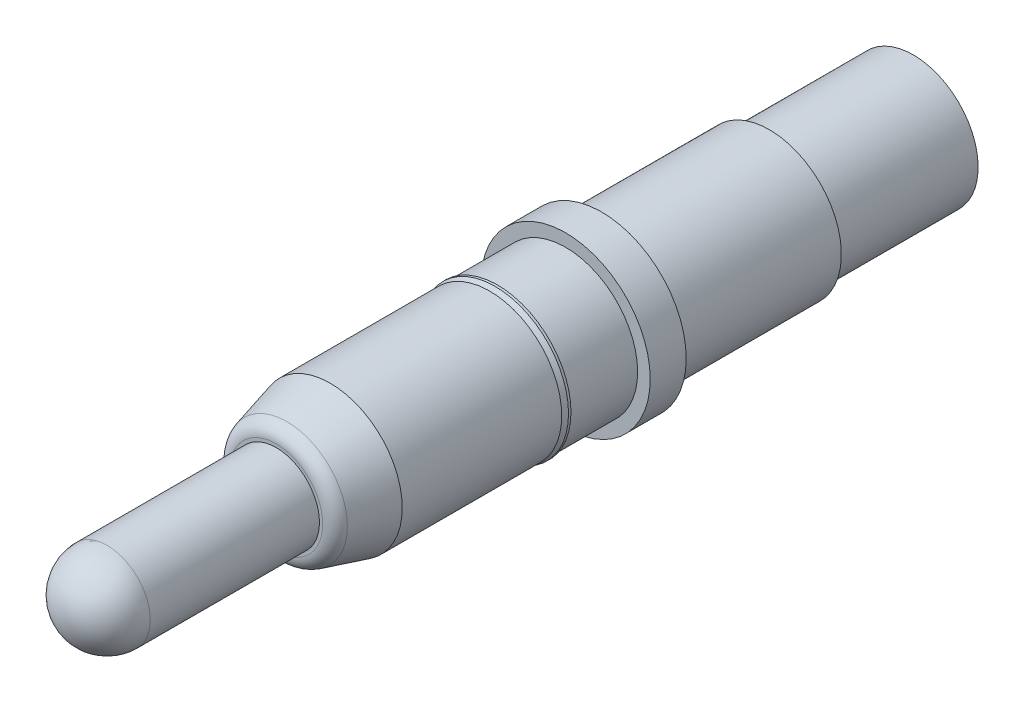
ISO-10303-21;
HEADER;
FILE_DESCRIPTION(('STEP AP214'),'2;1');
FILE_NAME('part.step','',(''),(''),'','','');
FILE_SCHEMA(('AUTOMOTIVE_DESIGN { 1 0 10303 214 1 1 1 1 }'));
ENDSEC;
DATA;
#1=APPLICATION_CONTEXT('core data for automotive mechanical design processes');
#2=APPLICATION_PROTOCOL_DEFINITION('international standard','automotive_design',2000,#1);
#3=PRODUCT_CONTEXT('',#1,'mechanical');
#4=PRODUCT('Part','Part','',(#3));
#5=PRODUCT_RELATED_PRODUCT_CATEGORY('part','',(#4));
#6=PRODUCT_DEFINITION_FORMATION('','',#4);
#7=PRODUCT_DEFINITION_CONTEXT('part definition',#1,'design');
#8=PRODUCT_DEFINITION('design','',#6,#7);
#9=PRODUCT_DEFINITION_SHAPE('','',#8);
#10=(LENGTH_UNIT() NAMED_UNIT(*) SI_UNIT(.MILLI.,.METRE.));
#11=(NAMED_UNIT(*) PLANE_ANGLE_UNIT() SI_UNIT($,.RADIAN.));
#12=(NAMED_UNIT(*) SI_UNIT($,.STERADIAN.) SOLID_ANGLE_UNIT());
#13=UNCERTAINTY_MEASURE_WITH_UNIT(LENGTH_MEASURE(1.E-05),#10,'distance_accuracy_value','');
#14=(GEOMETRIC_REPRESENTATION_CONTEXT(3) GLOBAL_UNCERTAINTY_ASSIGNED_CONTEXT((#13)) GLOBAL_UNIT_ASSIGNED_CONTEXT((#10,
#11,#12)) REPRESENTATION_CONTEXT('',''));
#15=CARTESIAN_POINT('',(0.,0.,0.));
#16=DIRECTION('',(0.,0.,1.));
#17=DIRECTION('',(1.,0.,0.));
#18=AXIS2_PLACEMENT_3D('',#15,#16,#17);
#19=CARTESIAN_POINT('',(0.,0.,-0.5));
#20=DIRECTION('',(0.,0.,1.));
#21=DIRECTION('',(1.,0.,0.));
#22=AXIS2_PLACEMENT_3D('',#19,#20,#21);
#23=CYLINDRICAL_SURFACE('',#22,1.175);
#24=CARTESIAN_POINT('',(0.,0.,-0.5));
#25=DIRECTION('',(0.,0.,1.));
#26=DIRECTION('',(1.,0.,0.));
#27=AXIS2_PLACEMENT_3D('',#24,#25,#26);
#28=CIRCLE('',#27,1.175);
#29=CARTESIAN_POINT('',(1.175,0.,-0.5));
#30=VERTEX_POINT('',#29);
#31=EDGE_CURVE('P0_E142',#30,#30,#28,.T.);
#32=ORIENTED_EDGE('',*,*,#31,.T.);
#33=EDGE_LOOP('',(#32));
#34=FACE_BOUND('',#33,.T.);
#35=CARTESIAN_POINT('',(0.,0.,0.));
#36=DIRECTION('',(0.,0.,1.));
#37=DIRECTION('',(1.,0.,0.));
#38=AXIS2_PLACEMENT_3D('',#35,#36,#37);
#39=CIRCLE('',#38,1.175);
#40=CARTESIAN_POINT('',(1.175,0.,0.));
#41=VERTEX_POINT('',#40);
#42=EDGE_CURVE('P0_E78',#41,#41,#39,.T.);
#43=ORIENTED_EDGE('',*,*,#42,.F.);
#44=EDGE_LOOP('',(#43));
#45=FACE_BOUND('',#44,.T.);
#46=ADVANCED_FACE('P0_F42',(#34,#45),#23,.T.);
#47=CARTESIAN_POINT('',(1.175,0.,-0.5));
#48=DIRECTION('',(0.,0.,-1.));
#49=DIRECTION('',(-1.,0.,0.));
#50=AXIS2_PLACEMENT_3D('',#47,#48,#49);
#51=PLANE('',#50);
#52=CARTESIAN_POINT('',(0.,0.,-0.5));
#53=DIRECTION('',(0.,0.,-1.));
#54=DIRECTION('',(-1.,0.,0.));
#55=AXIS2_PLACEMENT_3D('',#52,#53,#54);
#56=CIRCLE('',#55,1.);
#57=CARTESIAN_POINT('',(-1.,0.,-0.5));
#58=VERTEX_POINT('',#57);
#59=EDGE_CURVE('P0_E71',#58,#58,#56,.T.);
#60=ORIENTED_EDGE('',*,*,#59,.F.);
#61=EDGE_LOOP('',(#60));
#62=FACE_BOUND('',#61,.T.);
#63=ORIENTED_EDGE('',*,*,#31,.F.);
#64=EDGE_LOOP('',(#63));
#65=FACE_BOUND('',#64,.T.);
#66=ADVANCED_FACE('P0_F116',(#62,#65),#51,.T.);
#67=CARTESIAN_POINT('',(0.,0.,4.02));
#68=DIRECTION('',(0.,0.,1.));
#69=DIRECTION('',(1.,0.,0.));
#70=AXIS2_PLACEMENT_3D('',#67,#68,#69);
#71=PLANE('',#70);
#72=CARTESIAN_POINT('',(0.,0.,4.02));
#73=DIRECTION('',(0.,0.,1.));
#74=DIRECTION('',(1.,0.,0.));
#75=AXIS2_PLACEMENT_3D('',#72,#73,#74);
#76=CIRCLE('',#75,0.645572708091596);
#77=CARTESIAN_POINT('',(0.645572708091596,0.,4.02));
#78=VERTEX_POINT('',#77);
#79=EDGE_CURVE('P0_E50',#78,#78,#76,.T.);
#80=ORIENTED_EDGE('',*,*,#79,.T.);
#81=EDGE_LOOP('',(#80));
#82=FACE_BOUND('',#81,.T.);
#83=CARTESIAN_POINT('',(0.,0.,4.02));
#84=DIRECTION('',(0.,0.,1.));
#85=DIRECTION('',(1.,0.,0.));
#86=AXIS2_PLACEMENT_3D('',#83,#84,#85);
#87=CIRCLE('',#86,0.6);
#88=CARTESIAN_POINT('',(0.6,0.,4.02));
#89=VERTEX_POINT('',#88);
#90=EDGE_CURVE('P0_E62',#89,#89,#87,.T.);
#91=ORIENTED_EDGE('',*,*,#90,.F.);
#92=EDGE_LOOP('',(#91));
#93=FACE_BOUND('',#92,.T.);
#94=ADVANCED_FACE('P0_F112',(#82,#93),#71,.T.);
#95=CARTESIAN_POINT('',(0.,0.,4.02));
#96=DIRECTION('',(0.,0.,-1.));
#97=DIRECTION('',(-1.,0.,0.));
#98=AXIS2_PLACEMENT_3D('',#95,#96,#97);
#99=CONICAL_SURFACE('',#98,0.799038105690031,0.261799387782513);
#100=CARTESIAN_POINT('',(0.,0.,3.87176380901729));
#101=DIRECTION('',(0.,0.,1.));
#102=DIRECTION('',(1.,0.,0.));
#103=AXIS2_PLACEMENT_3D('',#100,#101,#102);
#104=CIRCLE('',#103,0.838757873350271);
#105=CARTESIAN_POINT('',(0.838757873350271,0.,3.87176380901729));
#106=VERTEX_POINT('',#105);
#107=EDGE_CURVE('P0_E11',#106,#106,#104,.F.);
#108=ORIENTED_EDGE('',*,*,#107,.T.);
#109=EDGE_LOOP('',(#108));
#110=FACE_BOUND('',#109,.T.);
#111=CARTESIAN_POINT('',(0.,0.,3.27));
#112=DIRECTION('',(0.,0.,1.));
#113=DIRECTION('',(1.,0.,0.));
#114=AXIS2_PLACEMENT_3D('',#111,#112,#113);
#115=CIRCLE('',#114,1.);
#116=CARTESIAN_POINT('',(1.,0.,3.27));
#117=VERTEX_POINT('',#116);
#118=EDGE_CURVE('P0_E146',#117,#117,#115,.T.);
#119=ORIENTED_EDGE('',*,*,#118,.T.);
#120=EDGE_LOOP('',(#119));
#121=FACE_BOUND('',#120,.T.);
#122=ADVANCED_FACE('P0_F108',(#110,#121),#99,.T.);
#123=CARTESIAN_POINT('',(0.,0.,-0.5));
#124=DIRECTION('',(0.,0.,1.));
#125=DIRECTION('',(1.,0.,0.));
#126=AXIS2_PLACEMENT_3D('',#123,#124,#125);
#127=CYLINDRICAL_SURFACE('',#126,1.);
#128=CARTESIAN_POINT('',(0.,0.,1.05442139880552));
#129=DIRECTION('',(0.,0.,1.));
#130=DIRECTION('',(1.,0.,0.));
#131=AXIS2_PLACEMENT_3D('',#128,#129,#130);
#132=CIRCLE('',#131,1.);
#133=CARTESIAN_POINT('',(1.,0.,1.05442139880552));
#134=VERTEX_POINT('',#133);
#135=EDGE_CURVE('P0_E170',#134,#134,#132,.T.);
#136=ORIENTED_EDGE('',*,*,#135,.T.);
#137=EDGE_LOOP('',(#136));
#138=FACE_BOUND('',#137,.T.);
#139=ORIENTED_EDGE('',*,*,#118,.F.);
#140=EDGE_LOOP('',(#139));
#141=FACE_BOUND('',#140,.T.);
#142=ADVANCED_FACE('P0_F104',(#138,#141),#127,.T.);
#143=CARTESIAN_POINT('',(0.,0.,1.05442139880552));
#144=DIRECTION('',(0.,0.,-1.));
#145=DIRECTION('',(-1.,0.,0.));
#146=AXIS2_PLACEMENT_3D('',#143,#144,#145);
#147=CONICAL_SURFACE('',#146,1.,0.26179938795119);
#148=CARTESIAN_POINT('',(0.,0.,0.979780382717352));
#149=DIRECTION('',(0.,0.,1.));
#150=DIRECTION('',(1.,0.,0.));
#151=AXIS2_PLACEMENT_3D('',#148,#149,#150);
#152=CIRCLE('',#151,1.01999999999523);
#153=CARTESIAN_POINT('',(1.01999999999523,0.,0.979780382717352));
#154=VERTEX_POINT('',#153);
#155=EDGE_CURVE('P0_E167',#154,#154,#152,.T.);
#156=ORIENTED_EDGE('',*,*,#155,.T.);
#157=EDGE_LOOP('',(#156));
#158=FACE_BOUND('',#157,.T.);
#159=ORIENTED_EDGE('',*,*,#135,.F.);
#160=EDGE_LOOP('',(#159));
#161=FACE_BOUND('',#160,.T.);
#162=ADVANCED_FACE('P0_F100',(#158,#161),#147,.T.);
#163=CARTESIAN_POINT('',(0.,0.,-0.5));
#164=DIRECTION('',(0.,0.,1.));
#165=DIRECTION('',(1.,0.,0.));
#166=AXIS2_PLACEMENT_3D('',#163,#164,#165);
#167=CYLINDRICAL_SURFACE('',#166,1.01999999999523);
#168=CARTESIAN_POINT('',(0.,0.,0.946167322600402));
#169=DIRECTION('',(0.,0.,1.));
#170=DIRECTION('',(1.,0.,0.));
#171=AXIS2_PLACEMENT_3D('',#168,#169,#170);
#172=CIRCLE('',#171,1.01999999999523);
#173=CARTESIAN_POINT('',(1.01999999999523,0.,0.946167322600402));
#174=VERTEX_POINT('',#173);
#175=EDGE_CURVE('P0_E162',#174,#174,#172,.T.);
#176=ORIENTED_EDGE('',*,*,#175,.T.);
#177=EDGE_LOOP('',(#176));
#178=FACE_BOUND('',#177,.T.);
#179=ORIENTED_EDGE('',*,*,#155,.F.);
#180=EDGE_LOOP('',(#179));
#181=FACE_BOUND('',#180,.T.);
#182=ADVANCED_FACE('P0_F96',(#178,#181),#167,.T.);
#183=CARTESIAN_POINT('',(1.01999999999523,0.,0.946167322600402));
#184=DIRECTION('',(0.,0.,-1.));
#185=DIRECTION('',(-1.,0.,0.));
#186=AXIS2_PLACEMENT_3D('',#183,#184,#185);
#187=PLANE('',#186);
#188=CARTESIAN_POINT('',(0.,0.,0.946167322600402));
#189=DIRECTION('',(0.,0.,1.));
#190=DIRECTION('',(1.,0.,0.));
#191=AXIS2_PLACEMENT_3D('',#188,#189,#190);
#192=CIRCLE('',#191,1.);
#193=CARTESIAN_POINT('',(1.,0.,0.946167322600402));
#194=VERTEX_POINT('',#193);
#195=EDGE_CURVE('P0_E159',#194,#194,#192,.T.);
#196=ORIENTED_EDGE('',*,*,#195,.T.);
#197=EDGE_LOOP('',(#196));
#198=FACE_BOUND('',#197,.T.);
#199=ORIENTED_EDGE('',*,*,#175,.F.);
#200=EDGE_LOOP('',(#199));
#201=FACE_BOUND('',#200,.T.);
#202=ADVANCED_FACE('P0_F92',(#198,#201),#187,.T.);
#203=CARTESIAN_POINT('',(0.,0.,-0.5));
#204=DIRECTION('',(0.,0.,1.));
#205=DIRECTION('',(1.,0.,0.));
#206=AXIS2_PLACEMENT_3D('',#203,#204,#205);
#207=CYLINDRICAL_SURFACE('',#206,1.);
#208=CARTESIAN_POINT('',(0.,0.,0.));
#209=DIRECTION('',(0.,0.,1.));
#210=DIRECTION('',(1.,0.,0.));
#211=AXIS2_PLACEMENT_3D('',#208,#209,#210);
#212=CIRCLE('',#211,1.);
#213=CARTESIAN_POINT('',(1.,0.,0.));
#214=VERTEX_POINT('',#213);
#215=EDGE_CURVE('P0_E156',#214,#214,#212,.T.);
#216=ORIENTED_EDGE('',*,*,#215,.T.);
#217=EDGE_LOOP('',(#216));
#218=FACE_BOUND('',#217,.T.);
#219=ORIENTED_EDGE('',*,*,#195,.F.);
#220=EDGE_LOOP('',(#219));
#221=FACE_BOUND('',#220,.T.);
#222=ADVANCED_FACE('P0_F88',(#218,#221),#207,.T.);
#223=CARTESIAN_POINT('',(1.,0.,0.));
#224=DIRECTION('',(0.,0.,1.));
#225=DIRECTION('',(1.,0.,0.));
#226=AXIS2_PLACEMENT_3D('',#223,#224,#225);
#227=PLANE('',#226);
#228=ORIENTED_EDGE('',*,*,#42,.T.);
#229=EDGE_LOOP('',(#228));
#230=FACE_BOUND('',#229,.T.);
#231=ORIENTED_EDGE('',*,*,#215,.F.);
#232=EDGE_LOOP('',(#231));
#233=FACE_BOUND('',#232,.T.);
#234=ADVANCED_FACE('P0_F84',(#230,#233),#227,.T.);
#235=CARTESIAN_POINT('',(0.,0.,6.37));
#236=DIRECTION('',(0.,-1.,0.));
#237=DIRECTION('',(0.,0.,-1.));
#238=AXIS2_PLACEMENT_3D('',#235,#236,#237);
#239=SPHERICAL_SURFACE('',#238,0.6);
#240=CARTESIAN_POINT('',(0.,0.,6.37));
#241=DIRECTION('',(0.,0.,1.));
#242=DIRECTION('',(0.,-1.,0.));
#243=AXIS2_PLACEMENT_3D('',#240,#241,#242);
#244=CIRCLE('',#243,0.6);
#245=CARTESIAN_POINT('',(0.,0.6,6.37));
#246=VERTEX_POINT('',#245);
#247=CARTESIAN_POINT('',(0.,-0.6,6.37));
#248=VERTEX_POINT('',#247);
#249=EDGE_CURVE('P0_E58',#246,#248,#244,.F.);
#250=ORIENTED_EDGE('',*,*,#249,.F.);
#251=CARTESIAN_POINT('',(0.,0.,6.37));
#252=DIRECTION('',(0.,0.,1.));
#253=DIRECTION('',(0.,-1.,0.));
#254=AXIS2_PLACEMENT_3D('',#251,#252,#253);
#255=CIRCLE('',#254,0.6);
#256=EDGE_CURVE('P0_E56',#248,#246,#255,.F.);
#257=ORIENTED_EDGE('',*,*,#256,.F.);
#258=EDGE_LOOP('',(#250,#257));
#259=FACE_BOUND('',#258,.T.);
#260=ADVANCED_FACE('P0_F59',(#259),#239,.T.);
#261=CARTESIAN_POINT('',(0.,0.,8.12857639578479));
#262=DIRECTION('',(0.,0.,-1.));
#263=DIRECTION('',(-1.,0.,0.));
#264=AXIS2_PLACEMENT_3D('',#261,#262,#263);
#265=CYLINDRICAL_SURFACE('',#264,0.6);
#266=ORIENTED_EDGE('',*,*,#256,.T.);
#267=ORIENTED_EDGE('',*,*,#249,.T.);
#268=EDGE_LOOP('',(#266,#267));
#269=FACE_BOUND('',#268,.T.);
#270=ORIENTED_EDGE('',*,*,#90,.T.);
#271=EDGE_LOOP('',(#270));
#272=FACE_BOUND('',#271,.T.);
#273=ADVANCED_FACE('P0_F64',(#269,#272),#265,.T.);
#274=CARTESIAN_POINT('',(0.,0.,-2.83));
#275=DIRECTION('',(0.,0.,1.));
#276=DIRECTION('',(1.,0.,0.));
#277=AXIS2_PLACEMENT_3D('',#274,#275,#276);
#278=CYLINDRICAL_SURFACE('',#277,1.);
#279=CARTESIAN_POINT('',(0.,0.,-2.83));
#280=DIRECTION('',(0.,0.,-1.));
#281=DIRECTION('',(-1.,0.,0.));
#282=AXIS2_PLACEMENT_3D('',#279,#280,#281);
#283=CIRCLE('',#282,1.);
#284=CARTESIAN_POINT('',(-1.,0.,-2.83));
#285=VERTEX_POINT('',#284);
#286=EDGE_CURVE('P0_E67',#285,#285,#283,.T.);
#287=ORIENTED_EDGE('',*,*,#286,.F.);
#288=EDGE_LOOP('',(#287));
#289=FACE_BOUND('',#288,.T.);
#290=ORIENTED_EDGE('',*,*,#59,.T.);
#291=EDGE_LOOP('',(#290));
#292=FACE_BOUND('',#291,.T.);
#293=ADVANCED_FACE('P0_F187',(#289,#292),#278,.T.);
#294=CARTESIAN_POINT('',(0.,0.,-2.83));
#295=DIRECTION('',(0.,0.,-1.));
#296=DIRECTION('',(-1.,0.,0.));
#297=AXIS2_PLACEMENT_3D('',#294,#295,#296);
#298=PLANE('',#297);
#299=CARTESIAN_POINT('',(0.,0.,-2.83));
#300=DIRECTION('',(0.,0.,-1.));
#301=DIRECTION('',(-1.,0.,0.));
#302=AXIS2_PLACEMENT_3D('',#299,#300,#301);
#303=CIRCLE('',#302,0.9);
#304=CARTESIAN_POINT('',(-0.9,0.,-2.83));
#305=VERTEX_POINT('',#304);
#306=EDGE_CURVE('P0_E238',#305,#305,#303,.T.);
#307=ORIENTED_EDGE('',*,*,#306,.F.);
#308=EDGE_LOOP('',(#307));
#309=FACE_BOUND('',#308,.T.);
#310=ORIENTED_EDGE('',*,*,#286,.T.);
#311=EDGE_LOOP('',(#310));
#312=FACE_BOUND('',#311,.T.);
#313=ADVANCED_FACE('P0_F191',(#309,#312),#298,.T.);
#314=CARTESIAN_POINT('',(0.,0.,-4.83));
#315=DIRECTION('',(0.,0.,1.));
#316=DIRECTION('',(1.,0.,0.));
#317=AXIS2_PLACEMENT_3D('',#314,#315,#316);
#318=CYLINDRICAL_SURFACE('',#317,0.9);
#319=CARTESIAN_POINT('',(0.,0.,-4.83));
#320=DIRECTION('',(0.,0.,-1.));
#321=DIRECTION('',(-1.,0.,0.));
#322=AXIS2_PLACEMENT_3D('',#319,#320,#321);
#323=CIRCLE('',#322,0.9);
#324=CARTESIAN_POINT('',(-0.9,0.,-4.83));
#325=VERTEX_POINT('',#324);
#326=EDGE_CURVE('P0_E239',#325,#325,#323,.T.);
#327=ORIENTED_EDGE('',*,*,#326,.F.);
#328=EDGE_LOOP('',(#327));
#329=FACE_BOUND('',#328,.T.);
#330=ORIENTED_EDGE('',*,*,#306,.T.);
#331=EDGE_LOOP('',(#330));
#332=FACE_BOUND('',#331,.T.);
#333=ADVANCED_FACE('P0_F196',(#329,#332),#318,.T.);
#334=CARTESIAN_POINT('',(0.,0.,-4.83));
#335=DIRECTION('',(0.,0.,-1.));
#336=DIRECTION('',(-1.,0.,0.));
#337=AXIS2_PLACEMENT_3D('',#334,#335,#336);
#338=PLANE('',#337);
#339=CARTESIAN_POINT('',(0.,0.,-4.83));
#340=DIRECTION('',(0.,0.,-1.));
#341=DIRECTION('',(-1.,0.,0.));
#342=AXIS2_PLACEMENT_3D('',#339,#340,#341);
#343=CIRCLE('',#342,0.834999999974913);
#344=CARTESIAN_POINT('',(-0.834999999974913,0.,-4.83));
#345=VERTEX_POINT('',#344);
#346=EDGE_CURVE('P0_E138',#345,#345,#343,.F.);
#347=ORIENTED_EDGE('',*,*,#346,.T.);
#348=EDGE_LOOP('',(#347));
#349=FACE_BOUND('',#348,.T.);
#350=ORIENTED_EDGE('',*,*,#326,.T.);
#351=EDGE_LOOP('',(#350));
#352=FACE_BOUND('',#351,.T.);
#353=ADVANCED_FACE('P0_F204',(#349,#352),#338,.T.);
#354=CARTESIAN_POINT('',(0.,0.,-3.23));
#355=DIRECTION('',(0.,0.,1.));
#356=DIRECTION('',(1.,0.,0.));
#357=AXIS2_PLACEMENT_3D('',#354,#355,#356);
#358=PLANE('',#357);
#359=CARTESIAN_POINT('',(0.,0.,-3.23));
#360=DIRECTION('',(0.,0.,-1.));
#361=DIRECTION('',(-1.,0.,0.));
#362=AXIS2_PLACEMENT_3D('',#359,#360,#361);
#363=CIRCLE('',#362,0.735000000000013);
#364=CARTESIAN_POINT('',(-0.735000000000013,0.,-3.23));
#365=VERTEX_POINT('',#364);
#366=EDGE_CURVE('P0_E228',#365,#365,#363,.T.);
#367=ORIENTED_EDGE('',*,*,#366,.T.);
#368=EDGE_LOOP('',(#367));
#369=FACE_BOUND('',#368,.T.);
#370=ADVANCED_FACE('P0_F132',(#369),#358,.F.);
#371=CARTESIAN_POINT('',(0.,0.,-4.83));
#372=DIRECTION('',(0.,0.,-1.));
#373=DIRECTION('',(-1.,0.,0.));
#374=AXIS2_PLACEMENT_3D('',#371,#372,#373);
#375=CYLINDRICAL_SURFACE('',#374,0.735000000000013);
#376=CARTESIAN_POINT('',(0.,0.,-4.72999999996826));
#377=DIRECTION('',(0.,0.,-1.));
#378=DIRECTION('',(-1.,0.,0.));
#379=AXIS2_PLACEMENT_3D('',#376,#377,#378);
#380=CIRCLE('',#379,0.735000000000013);
#381=CARTESIAN_POINT('',(-0.735000000000013,0.,-4.72999999996826));
#382=VERTEX_POINT('',#381);
#383=EDGE_CURVE('P0_E141',#382,#382,#380,.T.);
#384=ORIENTED_EDGE('',*,*,#383,.T.);
#385=EDGE_LOOP('',(#384));
#386=FACE_BOUND('',#385,.T.);
#387=ORIENTED_EDGE('',*,*,#366,.F.);
#388=EDGE_LOOP('',(#387));
#389=FACE_BOUND('',#388,.T.);
#390=ADVANCED_FACE('P0_F125',(#386,#389),#375,.F.);
#391=CARTESIAN_POINT('',(0.,0.,-4.72999999996826));
#392=DIRECTION('',(0.,0.,-1.));
#393=DIRECTION('',(-1.,0.,0.));
#394=AXIS2_PLACEMENT_3D('',#391,#392,#393);
#395=CONICAL_SURFACE('',#394,0.735000000000013,0.785398163113231);
#396=ORIENTED_EDGE('',*,*,#346,.F.);
#397=EDGE_LOOP('',(#396));
#398=FACE_BOUND('',#397,.T.);
#399=ORIENTED_EDGE('',*,*,#383,.F.);
#400=EDGE_LOOP('',(#399));
#401=FACE_BOUND('',#400,.T.);
#402=ADVANCED_FACE('P0_F123',(#398,#401),#395,.F.);
#403=CARTESIAN_POINT('',(0.,0.,3.82));
#404=DIRECTION('',(0.,0.,1.));
#405=DIRECTION('',(1.,0.,0.));
#406=AXIS2_PLACEMENT_3D('',#403,#404,#405);
#407=TOROIDAL_SURFACE('',#406,0.645572708091596,0.2);
#408=ORIENTED_EDGE('',*,*,#107,.F.);
#409=EDGE_LOOP('',(#408));
#410=FACE_BOUND('',#409,.T.);
#411=ORIENTED_EDGE('',*,*,#79,.F.);
#412=EDGE_LOOP('',(#411));
#413=FACE_BOUND('',#412,.T.);
#414=ADVANCED_FACE('P0_F44',(#410,#413),#407,.T.);
#415=CLOSED_SHELL('',(#46,#66,#94,#122,#142,#162,#182,#202,#222,#234,#260,#273,#293,#313,#333,
#353,#370,#390,#402,#414));
#416=CARTESIAN_POINT('',(0.,0.,-0.980000000000003));
#417=DIRECTION('',(0.,0.,1.));
#418=DIRECTION('',(1.,0.,0.));
#419=AXIS2_PLACEMENT_3D('',#416,#417,#418);
#420=CYLINDRICAL_SURFACE('',#419,0.6);
#421=CARTESIAN_POINT('',(0.,0.,-0.980000000000003));
#422=DIRECTION('',(0.,0.,1.));
#423=DIRECTION('',(1.,0.,0.));
#424=AXIS2_PLACEMENT_3D('',#421,#422,#423);
#425=CIRCLE('',#424,0.6);
#426=CARTESIAN_POINT('',(0.6,0.,-0.980000000000003));
#427=VERTEX_POINT('',#426);
#428=EDGE_CURVE('P0_E233',#427,#427,#425,.T.);
#429=ORIENTED_EDGE('',*,*,#428,.F.);
#430=EDGE_LOOP('',(#429));
#431=FACE_BOUND('',#430,.T.);
#432=CARTESIAN_POINT('',(0.,0.,3.02));
#433=DIRECTION('',(0.,0.,1.));
#434=DIRECTION('',(1.,0.,0.));
#435=AXIS2_PLACEMENT_3D('',#432,#433,#434);
#436=CIRCLE('',#435,0.6);
#437=CARTESIAN_POINT('',(0.6,0.,3.02));
#438=VERTEX_POINT('',#437);
#439=EDGE_CURVE('P0_E230',#438,#438,#436,.T.);
#440=ORIENTED_EDGE('',*,*,#439,.T.);
#441=EDGE_LOOP('',(#440));
#442=FACE_BOUND('',#441,.T.);
#443=ADVANCED_FACE('P0_F209',(#431,#442),#420,.F.);
#444=CARTESIAN_POINT('',(0.6,0.,-0.980000000000003));
#445=DIRECTION('',(0.,0.,-1.));
#446=DIRECTION('',(-1.,0.,0.));
#447=AXIS2_PLACEMENT_3D('',#444,#445,#446);
#448=PLANE('',#447);
#449=ORIENTED_EDGE('',*,*,#428,.T.);
#450=EDGE_LOOP('',(#449));
#451=FACE_BOUND('',#450,.T.);
#452=ADVANCED_FACE('P0_F212',(#451),#448,.F.);
#453=CARTESIAN_POINT('',(0.,0.,3.02));
#454=DIRECTION('',(0.,0.,1.));
#455=DIRECTION('',(1.,0.,0.));
#456=AXIS2_PLACEMENT_3D('',#453,#454,#455);
#457=PLANE('',#456);
#458=ORIENTED_EDGE('',*,*,#439,.F.);
#459=EDGE_LOOP('',(#458));
#460=FACE_BOUND('',#459,.T.);
#461=ADVANCED_FACE('P0_F217',(#460),#457,.F.);
#462=CLOSED_SHELL('',(#443,#452,#461));
#463=ORIENTED_CLOSED_SHELL('',*,#462,.T.);
#464=BREP_WITH_VOIDS('P0_B2',#415,(#463));
#465=CARTESIAN_POINT('',(0.,0.,6.37));
#466=DIRECTION('',(0.,-1.,0.));
#467=DIRECTION('',(0.,0.,-1.));
#468=AXIS2_PLACEMENT_3D('',#465,#466,#467);
#469=SPHERICAL_SURFACE('',#468,0.6);
#470=CARTESIAN_POINT('',(0.,0.,6.37));
#471=DIRECTION('',(0.,0.,1.));
#472=DIRECTION('',(0.,-1.,0.));
#473=AXIS2_PLACEMENT_3D('',#470,#471,#472);
#474=CIRCLE('',#473,0.6);
#475=CARTESIAN_POINT('',(0.,0.6,6.37));
#476=VERTEX_POINT('',#475);
#477=CARTESIAN_POINT('',(0.,-0.6,6.37));
#478=VERTEX_POINT('',#477);
#479=EDGE_CURVE('P1_E23',#476,#478,#474,.F.);
#480=ORIENTED_EDGE('',*,*,#479,.F.);
#481=CARTESIAN_POINT('',(0.,0.,6.37));
#482=DIRECTION('',(0.,0.,1.));
#483=DIRECTION('',(0.,-1.,0.));
#484=AXIS2_PLACEMENT_3D('',#481,#482,#483);
#485=CIRCLE('',#484,0.6);
#486=EDGE_CURVE('P1_E11',#478,#476,#485,.F.);
#487=ORIENTED_EDGE('',*,*,#486,.F.);
#488=EDGE_LOOP('',(#480,#487));
#489=FACE_BOUND('',#488,.T.);
#490=ADVANCED_FACE('P1_F17',(#489),#469,.T.);
#491=OPEN_SHELL('',(#490));
#492=SHELL_BASED_SURFACE_MODEL('P1_B1',(#491));
#493=ADVANCED_BREP_SHAPE_REPRESENTATION('',(#18,#464),#14);
#494=MANIFOLD_SURFACE_SHAPE_REPRESENTATION('',(#18,#492),#14);
#495=SHAPE_REPRESENTATION('',(#18),#14);
#496=SHAPE_DEFINITION_REPRESENTATION(#9,#495);
#497=SHAPE_REPRESENTATION_RELATIONSHIP('','',#495,#493);
#498=SHAPE_REPRESENTATION_RELATIONSHIP('','',#495,#494);
ENDSEC;
END-ISO-10303-21;
